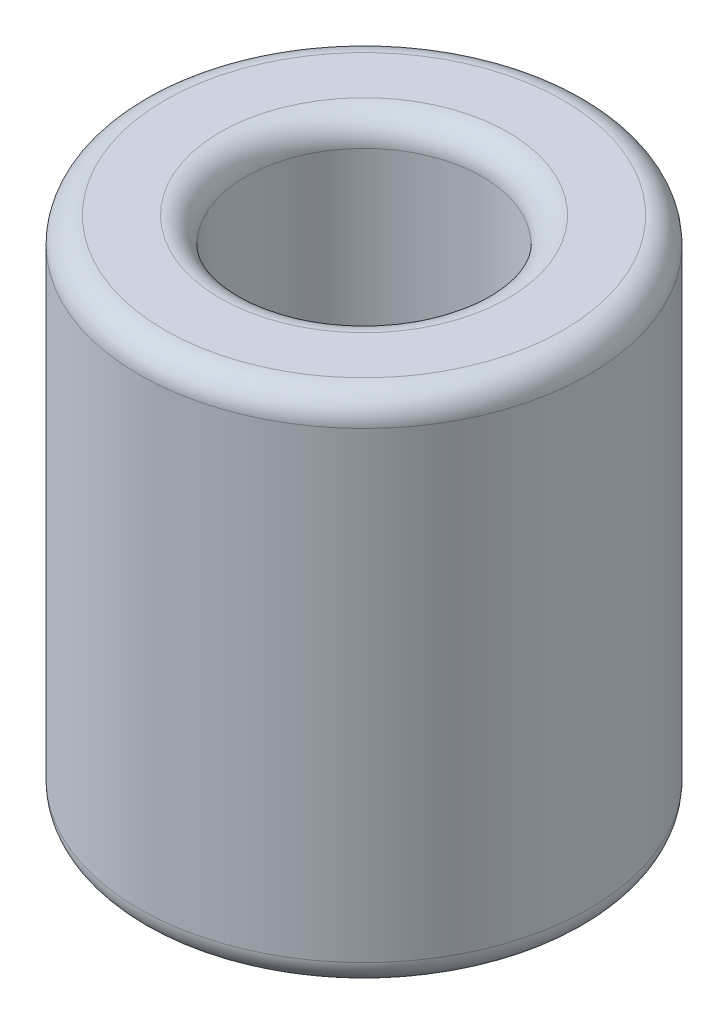
ISO-10303-21;
HEADER;
FILE_DESCRIPTION(('STEP AP214'),'2;1');
FILE_NAME('part.step','',(''),(''),'','','');
FILE_SCHEMA(('AUTOMOTIVE_DESIGN { 1 0 10303 214 1 1 1 1 }'));
ENDSEC;
DATA;
#1=APPLICATION_CONTEXT('core data for automotive mechanical design processes');
#2=APPLICATION_PROTOCOL_DEFINITION('international standard','automotive_design',2000,#1);
#3=PRODUCT_CONTEXT('',#1,'mechanical');
#4=PRODUCT('Part','Part','',(#3));
#5=PRODUCT_RELATED_PRODUCT_CATEGORY('part','',(#4));
#6=PRODUCT_DEFINITION_FORMATION('','',#4);
#7=PRODUCT_DEFINITION_CONTEXT('part definition',#1,'design');
#8=PRODUCT_DEFINITION('design','',#6,#7);
#9=PRODUCT_DEFINITION_SHAPE('','',#8);
#10=(LENGTH_UNIT() NAMED_UNIT(*) SI_UNIT(.MILLI.,.METRE.));
#11=(NAMED_UNIT(*) PLANE_ANGLE_UNIT() SI_UNIT($,.RADIAN.));
#12=(NAMED_UNIT(*) SI_UNIT($,.STERADIAN.) SOLID_ANGLE_UNIT());
#13=UNCERTAINTY_MEASURE_WITH_UNIT(LENGTH_MEASURE(1.E-05),#10,'distance_accuracy_value','');
#14=(GEOMETRIC_REPRESENTATION_CONTEXT(3) GLOBAL_UNCERTAINTY_ASSIGNED_CONTEXT((#13)) GLOBAL_UNIT_ASSIGNED_CONTEXT((#10,
#11,#12)) REPRESENTATION_CONTEXT('',''));
#15=CARTESIAN_POINT('',(0.,0.,0.));
#16=DIRECTION('',(0.,0.,1.));
#17=DIRECTION('',(1.,0.,0.));
#18=AXIS2_PLACEMENT_3D('',#15,#16,#17);
#19=CARTESIAN_POINT('',(0.,10.,0.));
#20=DIRECTION('',(0.,1.,0.));
#21=DIRECTION('',(0.,0.,1.));
#22=AXIS2_PLACEMENT_3D('',#19,#20,#21);
#23=PLANE('',#22);
#24=CARTESIAN_POINT('',(0.,10.,0.));
#25=DIRECTION('',(0.,1.,0.));
#26=DIRECTION('',(0.,0.,1.));
#27=AXIS2_PLACEMENT_3D('',#24,#25,#26);
#28=CIRCLE('',#27,2.8);
#29=CARTESIAN_POINT('',(0.,10.,2.8));
#30=VERTEX_POINT('',#29);
#31=EDGE_CURVE('E10',#30,#30,#28,.F.);
#32=ORIENTED_EDGE('',*,*,#31,.T.);
#33=EDGE_LOOP('',(#32));
#34=FACE_BOUND('',#33,.T.);
#35=CARTESIAN_POINT('',(0.,10.,0.));
#36=DIRECTION('',(0.,1.,0.));
#37=DIRECTION('',(0.,0.,1.));
#38=AXIS2_PLACEMENT_3D('',#35,#36,#37);
#39=CIRCLE('',#38,3.875);
#40=CARTESIAN_POINT('',(0.,10.,3.875));
#41=VERTEX_POINT('',#40);
#42=EDGE_CURVE('E37',#41,#41,#39,.T.);
#43=ORIENTED_EDGE('',*,*,#42,.T.);
#44=EDGE_LOOP('',(#43));
#45=FACE_BOUND('',#44,.T.);
#46=ADVANCED_FACE('F30',(#34,#45),#23,.T.);
#47=CARTESIAN_POINT('',(0.,0.,0.));
#48=DIRECTION('',(0.,1.,0.));
#49=DIRECTION('',(0.,0.,1.));
#50=AXIS2_PLACEMENT_3D('',#47,#48,#49);
#51=PLANE('',#50);
#52=CARTESIAN_POINT('',(0.,0.,0.));
#53=DIRECTION('',(0.,1.,0.));
#54=DIRECTION('',(0.,0.,1.));
#55=AXIS2_PLACEMENT_3D('',#52,#53,#54);
#56=CIRCLE('',#55,2.8);
#57=CARTESIAN_POINT('',(0.,0.,2.8));
#58=VERTEX_POINT('',#57);
#59=EDGE_CURVE('E56',#58,#58,#56,.T.);
#60=ORIENTED_EDGE('',*,*,#59,.T.);
#61=EDGE_LOOP('',(#60));
#62=FACE_BOUND('',#61,.T.);
#63=CARTESIAN_POINT('',(0.,0.,0.));
#64=DIRECTION('',(0.,1.,0.));
#65=DIRECTION('',(0.,0.,1.));
#66=AXIS2_PLACEMENT_3D('',#63,#64,#65);
#67=CIRCLE('',#66,3.875);
#68=CARTESIAN_POINT('',(0.,0.,3.875));
#69=VERTEX_POINT('',#68);
#70=EDGE_CURVE('E59',#69,#69,#67,.F.);
#71=ORIENTED_EDGE('',*,*,#70,.T.);
#72=EDGE_LOOP('',(#71));
#73=FACE_BOUND('',#72,.T.);
#74=ADVANCED_FACE('F63',(#62,#73),#51,.F.);
#75=CARTESIAN_POINT('',(0.,10.,0.));
#76=DIRECTION('',(0.,-1.,0.));
#77=DIRECTION('',(0.,0.,-1.));
#78=AXIS2_PLACEMENT_3D('',#75,#76,#77);
#79=CYLINDRICAL_SURFACE('',#78,4.375);
#80=CARTESIAN_POINT('',(0.,0.5,0.));
#81=DIRECTION('',(0.,1.,0.));
#82=DIRECTION('',(0.,0.,1.));
#83=AXIS2_PLACEMENT_3D('',#80,#81,#82);
#84=CIRCLE('',#83,4.375);
#85=CARTESIAN_POINT('',(0.,0.5,4.375));
#86=VERTEX_POINT('',#85);
#87=EDGE_CURVE('E41',#86,#86,#84,.T.);
#88=ORIENTED_EDGE('',*,*,#87,.T.);
#89=EDGE_LOOP('',(#88));
#90=FACE_BOUND('',#89,.T.);
#91=CARTESIAN_POINT('',(0.,9.5,0.));
#92=DIRECTION('',(0.,1.,0.));
#93=DIRECTION('',(0.,0.,1.));
#94=AXIS2_PLACEMENT_3D('',#91,#92,#93);
#95=CIRCLE('',#94,4.375);
#96=CARTESIAN_POINT('',(0.,9.5,4.375));
#97=VERTEX_POINT('',#96);
#98=EDGE_CURVE('E45',#97,#97,#95,.F.);
#99=ORIENTED_EDGE('',*,*,#98,.T.);
#100=EDGE_LOOP('',(#99));
#101=FACE_BOUND('',#100,.T.);
#102=ADVANCED_FACE('F73',(#90,#101),#79,.T.);
#103=CARTESIAN_POINT('',(0.,10.,0.));
#104=DIRECTION('',(0.,-1.,0.));
#105=DIRECTION('',(0.,0.,-1.));
#106=AXIS2_PLACEMENT_3D('',#103,#104,#105);
#107=CYLINDRICAL_SURFACE('',#106,2.3);
#108=CARTESIAN_POINT('',(0.,0.5,0.));
#109=DIRECTION('',(0.,1.,0.));
#110=DIRECTION('',(0.,0.,1.));
#111=AXIS2_PLACEMENT_3D('',#108,#109,#110);
#112=CIRCLE('',#111,2.3);
#113=CARTESIAN_POINT('',(0.,0.5,2.3));
#114=VERTEX_POINT('',#113);
#115=EDGE_CURVE('E50',#114,#114,#112,.F.);
#116=ORIENTED_EDGE('',*,*,#115,.T.);
#117=EDGE_LOOP('',(#116));
#118=FACE_BOUND('',#117,.T.);
#119=CARTESIAN_POINT('',(0.,9.5,0.));
#120=DIRECTION('',(0.,1.,0.));
#121=DIRECTION('',(0.,0.,1.));
#122=AXIS2_PLACEMENT_3D('',#119,#120,#121);
#123=CIRCLE('',#122,2.3);
#124=CARTESIAN_POINT('',(0.,9.5,2.3));
#125=VERTEX_POINT('',#124);
#126=EDGE_CURVE('E53',#125,#125,#123,.T.);
#127=ORIENTED_EDGE('',*,*,#126,.T.);
#128=EDGE_LOOP('',(#127));
#129=FACE_BOUND('',#128,.T.);
#130=ADVANCED_FACE('F76',(#118,#129),#107,.F.);
#131=CARTESIAN_POINT('',(0.,0.5,0.));
#132=DIRECTION('',(0.,1.,0.));
#133=DIRECTION('',(0.,0.,1.));
#134=AXIS2_PLACEMENT_3D('',#131,#132,#133);
#135=TOROIDAL_SURFACE('',#134,2.8,0.5);
#136=ORIENTED_EDGE('',*,*,#115,.F.);
#137=EDGE_LOOP('',(#136));
#138=FACE_BOUND('',#137,.T.);
#139=ORIENTED_EDGE('',*,*,#59,.F.);
#140=EDGE_LOOP('',(#139));
#141=FACE_BOUND('',#140,.T.);
#142=ADVANCED_FACE('F69',(#138,#141),#135,.T.);
#143=CARTESIAN_POINT('',(0.,0.5,0.));
#144=DIRECTION('',(0.,1.,0.));
#145=DIRECTION('',(0.,0.,1.));
#146=AXIS2_PLACEMENT_3D('',#143,#144,#145);
#147=TOROIDAL_SURFACE('',#146,3.875,0.5);
#148=ORIENTED_EDGE('',*,*,#70,.F.);
#149=EDGE_LOOP('',(#148));
#150=FACE_BOUND('',#149,.T.);
#151=ORIENTED_EDGE('',*,*,#87,.F.);
#152=EDGE_LOOP('',(#151));
#153=FACE_BOUND('',#152,.T.);
#154=ADVANCED_FACE('F65',(#150,#153),#147,.T.);
#155=CARTESIAN_POINT('',(0.,9.5,0.));
#156=DIRECTION('',(0.,1.,0.));
#157=DIRECTION('',(0.,0.,1.));
#158=AXIS2_PLACEMENT_3D('',#155,#156,#157);
#159=TOROIDAL_SURFACE('',#158,2.8,0.5);
#160=ORIENTED_EDGE('',*,*,#31,.F.);
#161=EDGE_LOOP('',(#160));
#162=FACE_BOUND('',#161,.T.);
#163=ORIENTED_EDGE('',*,*,#126,.F.);
#164=EDGE_LOOP('',(#163));
#165=FACE_BOUND('',#164,.T.);
#166=ADVANCED_FACE('F68',(#162,#165),#159,.T.);
#167=CARTESIAN_POINT('',(0.,9.5,0.));
#168=DIRECTION('',(0.,1.,0.));
#169=DIRECTION('',(0.,0.,1.));
#170=AXIS2_PLACEMENT_3D('',#167,#168,#169);
#171=TOROIDAL_SURFACE('',#170,3.875,0.5);
#172=ORIENTED_EDGE('',*,*,#98,.F.);
#173=EDGE_LOOP('',(#172));
#174=FACE_BOUND('',#173,.T.);
#175=ORIENTED_EDGE('',*,*,#42,.F.);
#176=EDGE_LOOP('',(#175));
#177=FACE_BOUND('',#176,.T.);
#178=ADVANCED_FACE('F32',(#174,#177),#171,.T.);
#179=CLOSED_SHELL('',(#46,#74,#102,#130,#142,#154,#166,#178));
#180=MANIFOLD_SOLID_BREP('B2',#179);
#181=ADVANCED_BREP_SHAPE_REPRESENTATION('',(#18,#180),#14);
#182=SHAPE_DEFINITION_REPRESENTATION(#9,#181);
ENDSEC;
END-ISO-10303-21;
